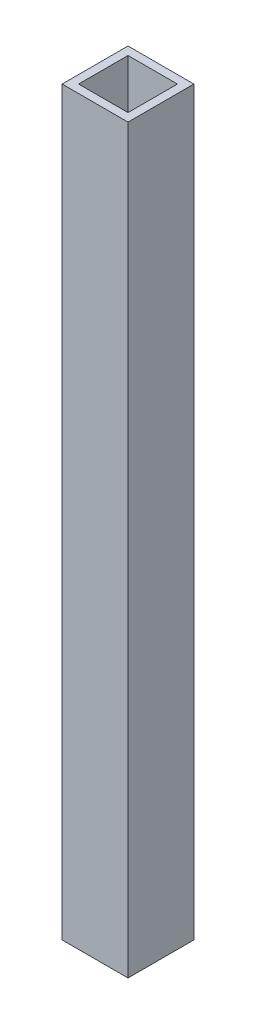
ISO-10303-21;
HEADER;
FILE_DESCRIPTION(('STEP AP214'),'2;1');
FILE_NAME('part.step','',(''),(''),'','','');
FILE_SCHEMA(('AUTOMOTIVE_DESIGN { 1 0 10303 214 1 1 1 1 }'));
ENDSEC;
DATA;
#1=APPLICATION_CONTEXT('core data for automotive mechanical design processes');
#2=APPLICATION_PROTOCOL_DEFINITION('international standard','automotive_design',2000,#1);
#3=PRODUCT_CONTEXT('',#1,'mechanical');
#4=PRODUCT('Part','Part','',(#3));
#5=PRODUCT_RELATED_PRODUCT_CATEGORY('part','',(#4));
#6=PRODUCT_DEFINITION_FORMATION('','',#4);
#7=PRODUCT_DEFINITION_CONTEXT('part definition',#1,'design');
#8=PRODUCT_DEFINITION('design','',#6,#7);
#9=PRODUCT_DEFINITION_SHAPE('','',#8);
#10=(LENGTH_UNIT() NAMED_UNIT(*) SI_UNIT(.MILLI.,.METRE.));
#11=(NAMED_UNIT(*) PLANE_ANGLE_UNIT() SI_UNIT($,.RADIAN.));
#12=(NAMED_UNIT(*) SI_UNIT($,.STERADIAN.) SOLID_ANGLE_UNIT());
#13=UNCERTAINTY_MEASURE_WITH_UNIT(LENGTH_MEASURE(1.E-05),#10,'distance_accuracy_value','');
#14=(GEOMETRIC_REPRESENTATION_CONTEXT(3) GLOBAL_UNCERTAINTY_ASSIGNED_CONTEXT((#13)) GLOBAL_UNIT_ASSIGNED_CONTEXT((#10,
#11,#12)) REPRESENTATION_CONTEXT('',''));
#15=CARTESIAN_POINT('',(0.,0.,0.));
#16=DIRECTION('',(0.,0.,1.));
#17=DIRECTION('',(1.,0.,0.));
#18=AXIS2_PLACEMENT_3D('',#15,#16,#17);
#19=CARTESIAN_POINT('',(0.,225.,0.));
#20=DIRECTION('',(0.,1.,0.));
#21=DIRECTION('',(0.,0.,1.));
#22=AXIS2_PLACEMENT_3D('',#19,#20,#21);
#23=PLANE('',#22);
#24=DIRECTION('',(0.,0.,1.));
#25=VECTOR('',#24,1.);
#26=CARTESIAN_POINT('',(-20.,225.,20.));
#27=LINE('',#26,#25);
#28=CARTESIAN_POINT('',(-20.,225.,-20.));
#29=VERTEX_POINT('',#28);
#30=CARTESIAN_POINT('',(-20.,225.,20.));
#31=VERTEX_POINT('',#30);
#32=EDGE_CURVE('E135',#29,#31,#27,.T.);
#33=ORIENTED_EDGE('',*,*,#32,.T.);
#34=DIRECTION('',(1.,0.,0.));
#35=VECTOR('',#34,1.);
#36=CARTESIAN_POINT('',(20.,225.,20.));
#37=LINE('',#36,#35);
#38=CARTESIAN_POINT('',(20.,225.,20.));
#39=VERTEX_POINT('',#38);
#40=EDGE_CURVE('E138',#31,#39,#37,.T.);
#41=ORIENTED_EDGE('',*,*,#40,.T.);
#42=DIRECTION('',(0.,0.,-1.));
#43=VECTOR('',#42,1.);
#44=CARTESIAN_POINT('',(20.,225.,20.));
#45=LINE('',#44,#43);
#46=CARTESIAN_POINT('',(20.,225.,-20.));
#47=VERTEX_POINT('',#46);
#48=EDGE_CURVE('E141',#39,#47,#45,.T.);
#49=ORIENTED_EDGE('',*,*,#48,.T.);
#50=DIRECTION('',(-1.,0.,0.));
#51=VECTOR('',#50,1.);
#52=CARTESIAN_POINT('',(20.,225.,-20.));
#53=LINE('',#52,#51);
#54=EDGE_CURVE('E143',#47,#29,#53,.T.);
#55=ORIENTED_EDGE('',*,*,#54,.T.);
#56=EDGE_LOOP('',(#33,#41,#49,#55));
#57=FACE_BOUND('',#56,.T.);
#58=DIRECTION('',(-1.,0.,0.));
#59=VECTOR('',#58,1.);
#60=CARTESIAN_POINT('',(15.,225.,-15.));
#61=LINE('',#60,#59);
#62=CARTESIAN_POINT('',(15.,225.,-15.));
#63=VERTEX_POINT('',#62);
#64=CARTESIAN_POINT('',(-15.,225.,-15.));
#65=VERTEX_POINT('',#64);
#66=EDGE_CURVE('E107',#63,#65,#61,.T.);
#67=ORIENTED_EDGE('',*,*,#66,.F.);
#68=DIRECTION('',(0.,0.,-1.));
#69=VECTOR('',#68,1.);
#70=CARTESIAN_POINT('',(15.,225.,15.));
#71=LINE('',#70,#69);
#72=CARTESIAN_POINT('',(15.,225.,15.));
#73=VERTEX_POINT('',#72);
#74=EDGE_CURVE('E99',#73,#63,#71,.T.);
#75=ORIENTED_EDGE('',*,*,#74,.F.);
#76=DIRECTION('',(1.,0.,0.));
#77=VECTOR('',#76,1.);
#78=CARTESIAN_POINT('',(15.,225.,15.));
#79=LINE('',#78,#77);
#80=CARTESIAN_POINT('',(-15.,225.,15.));
#81=VERTEX_POINT('',#80);
#82=EDGE_CURVE('E121',#81,#73,#79,.T.);
#83=ORIENTED_EDGE('',*,*,#82,.F.);
#84=DIRECTION('',(0.,0.,1.));
#85=VECTOR('',#84,1.);
#86=CARTESIAN_POINT('',(-15.,225.,15.));
#87=LINE('',#86,#85);
#88=EDGE_CURVE('E119',#65,#81,#87,.T.);
#89=ORIENTED_EDGE('',*,*,#88,.F.);
#90=EDGE_LOOP('',(#67,#75,#83,#89));
#91=FACE_BOUND('',#90,.T.);
#92=ADVANCED_FACE('F34',(#57,#91),#23,.T.);
#93=CARTESIAN_POINT('',(0.,-225.,0.));
#94=DIRECTION('',(0.,1.,0.));
#95=DIRECTION('',(0.,0.,1.));
#96=AXIS2_PLACEMENT_3D('',#93,#94,#95);
#97=PLANE('',#96);
#98=DIRECTION('',(0.,0.,1.));
#99=VECTOR('',#98,1.);
#100=CARTESIAN_POINT('',(-20.,-225.,20.));
#101=LINE('',#100,#99);
#102=CARTESIAN_POINT('',(-20.,-225.,-20.));
#103=VERTEX_POINT('',#102);
#104=CARTESIAN_POINT('',(-20.,-225.,20.));
#105=VERTEX_POINT('',#104);
#106=EDGE_CURVE('E115',#103,#105,#101,.T.);
#107=ORIENTED_EDGE('',*,*,#106,.F.);
#108=DIRECTION('',(-1.,0.,0.));
#109=VECTOR('',#108,1.);
#110=CARTESIAN_POINT('',(20.,-225.,-20.));
#111=LINE('',#110,#109);
#112=CARTESIAN_POINT('',(20.,-225.,-20.));
#113=VERTEX_POINT('',#112);
#114=EDGE_CURVE('E139',#113,#103,#111,.T.);
#115=ORIENTED_EDGE('',*,*,#114,.F.);
#116=DIRECTION('',(0.,0.,-1.));
#117=VECTOR('',#116,1.);
#118=CARTESIAN_POINT('',(20.,-225.,20.));
#119=LINE('',#118,#117);
#120=CARTESIAN_POINT('',(20.,-225.,20.));
#121=VERTEX_POINT('',#120);
#122=EDGE_CURVE('E150',#121,#113,#119,.T.);
#123=ORIENTED_EDGE('',*,*,#122,.F.);
#124=DIRECTION('',(1.,0.,0.));
#125=VECTOR('',#124,1.);
#126=CARTESIAN_POINT('',(20.,-225.,20.));
#127=LINE('',#126,#125);
#128=EDGE_CURVE('E148',#105,#121,#127,.T.);
#129=ORIENTED_EDGE('',*,*,#128,.F.);
#130=EDGE_LOOP('',(#107,#115,#123,#129));
#131=FACE_BOUND('',#130,.T.);
#132=DIRECTION('',(0.,0.,-1.));
#133=VECTOR('',#132,1.);
#134=CARTESIAN_POINT('',(15.,-225.,15.));
#135=LINE('',#134,#133);
#136=CARTESIAN_POINT('',(15.,-225.,15.));
#137=VERTEX_POINT('',#136);
#138=CARTESIAN_POINT('',(15.,-225.,-15.));
#139=VERTEX_POINT('',#138);
#140=EDGE_CURVE('E57',#137,#139,#135,.T.);
#141=ORIENTED_EDGE('',*,*,#140,.T.);
#142=DIRECTION('',(-1.,0.,0.));
#143=VECTOR('',#142,1.);
#144=CARTESIAN_POINT('',(15.,-225.,-15.));
#145=LINE('',#144,#143);
#146=CARTESIAN_POINT('',(-15.,-225.,-15.));
#147=VERTEX_POINT('',#146);
#148=EDGE_CURVE('E114',#139,#147,#145,.T.);
#149=ORIENTED_EDGE('',*,*,#148,.T.);
#150=DIRECTION('',(0.,0.,1.));
#151=VECTOR('',#150,1.);
#152=CARTESIAN_POINT('',(-15.,-225.,15.));
#153=LINE('',#152,#151);
#154=CARTESIAN_POINT('',(-15.,-225.,15.));
#155=VERTEX_POINT('',#154);
#156=EDGE_CURVE('E127',#147,#155,#153,.T.);
#157=ORIENTED_EDGE('',*,*,#156,.T.);
#158=DIRECTION('',(1.,0.,0.));
#159=VECTOR('',#158,1.);
#160=CARTESIAN_POINT('',(15.,-225.,15.));
#161=LINE('',#160,#159);
#162=EDGE_CURVE('E108',#155,#137,#161,.T.);
#163=ORIENTED_EDGE('',*,*,#162,.T.);
#164=EDGE_LOOP('',(#141,#149,#157,#163));
#165=FACE_BOUND('',#164,.T.);
#166=ADVANCED_FACE('F168',(#131,#165),#97,.F.);
#167=CARTESIAN_POINT('',(-20.,225.,20.));
#168=DIRECTION('',(1.,0.,0.));
#169=DIRECTION('',(0.,0.,-1.));
#170=AXIS2_PLACEMENT_3D('',#167,#168,#169);
#171=PLANE('',#170);
#172=ORIENTED_EDGE('',*,*,#106,.T.);
#173=DIRECTION('',(0.,-1.,0.));
#174=VECTOR('',#173,1.);
#175=CARTESIAN_POINT('',(-20.,225.,20.));
#176=LINE('',#175,#174);
#177=EDGE_CURVE('E11',#31,#105,#176,.T.);
#178=ORIENTED_EDGE('',*,*,#177,.F.);
#179=ORIENTED_EDGE('',*,*,#32,.F.);
#180=DIRECTION('',(0.,-1.,0.));
#181=VECTOR('',#180,1.);
#182=CARTESIAN_POINT('',(-20.,225.,-20.));
#183=LINE('',#182,#181);
#184=EDGE_CURVE('E145',#29,#103,#183,.T.);
#185=ORIENTED_EDGE('',*,*,#184,.T.);
#186=EDGE_LOOP('',(#172,#178,#179,#185));
#187=FACE_BOUND('',#186,.T.);
#188=ADVANCED_FACE('F36',(#187),#171,.F.);
#189=CARTESIAN_POINT('',(20.,225.,20.));
#190=DIRECTION('',(0.,0.,-1.));
#191=DIRECTION('',(-1.,0.,0.));
#192=AXIS2_PLACEMENT_3D('',#189,#190,#191);
#193=PLANE('',#192);
#194=ORIENTED_EDGE('',*,*,#128,.T.);
#195=DIRECTION('',(0.,-1.,0.));
#196=VECTOR('',#195,1.);
#197=CARTESIAN_POINT('',(20.,225.,20.));
#198=LINE('',#197,#196);
#199=EDGE_CURVE('E42',#39,#121,#198,.T.);
#200=ORIENTED_EDGE('',*,*,#199,.F.);
#201=ORIENTED_EDGE('',*,*,#40,.F.);
#202=ORIENTED_EDGE('',*,*,#177,.T.);
#203=EDGE_LOOP('',(#194,#200,#201,#202));
#204=FACE_BOUND('',#203,.T.);
#205=ADVANCED_FACE('F178',(#204),#193,.F.);
#206=CARTESIAN_POINT('',(20.,225.,20.));
#207=DIRECTION('',(-1.,0.,0.));
#208=DIRECTION('',(0.,0.,1.));
#209=AXIS2_PLACEMENT_3D('',#206,#207,#208);
#210=PLANE('',#209);
#211=ORIENTED_EDGE('',*,*,#122,.T.);
#212=DIRECTION('',(0.,-1.,0.));
#213=VECTOR('',#212,1.);
#214=CARTESIAN_POINT('',(20.,225.,-20.));
#215=LINE('',#214,#213);
#216=EDGE_CURVE('E155',#47,#113,#215,.T.);
#217=ORIENTED_EDGE('',*,*,#216,.F.);
#218=ORIENTED_EDGE('',*,*,#48,.F.);
#219=ORIENTED_EDGE('',*,*,#199,.T.);
#220=EDGE_LOOP('',(#211,#217,#218,#219));
#221=FACE_BOUND('',#220,.T.);
#222=ADVANCED_FACE('F162',(#221),#210,.F.);
#223=CARTESIAN_POINT('',(20.,225.,-20.));
#224=DIRECTION('',(0.,0.,1.));
#225=DIRECTION('',(1.,0.,0.));
#226=AXIS2_PLACEMENT_3D('',#223,#224,#225);
#227=PLANE('',#226);
#228=ORIENTED_EDGE('',*,*,#114,.T.);
#229=ORIENTED_EDGE('',*,*,#184,.F.);
#230=ORIENTED_EDGE('',*,*,#54,.F.);
#231=ORIENTED_EDGE('',*,*,#216,.T.);
#232=EDGE_LOOP('',(#228,#229,#230,#231));
#233=FACE_BOUND('',#232,.T.);
#234=ADVANCED_FACE('F172',(#233),#227,.F.);
#235=CARTESIAN_POINT('',(15.,225.,15.));
#236=DIRECTION('',(-1.,0.,0.));
#237=DIRECTION('',(0.,0.,1.));
#238=AXIS2_PLACEMENT_3D('',#235,#236,#237);
#239=PLANE('',#238);
#240=ORIENTED_EDGE('',*,*,#140,.F.);
#241=DIRECTION('',(0.,-1.,0.));
#242=VECTOR('',#241,1.);
#243=CARTESIAN_POINT('',(15.,225.,15.));
#244=LINE('',#243,#242);
#245=EDGE_CURVE('E103',#73,#137,#244,.T.);
#246=ORIENTED_EDGE('',*,*,#245,.F.);
#247=ORIENTED_EDGE('',*,*,#74,.T.);
#248=DIRECTION('',(0.,-1.,0.));
#249=VECTOR('',#248,1.);
#250=CARTESIAN_POINT('',(15.,225.,-15.));
#251=LINE('',#250,#249);
#252=EDGE_CURVE('E102',#63,#139,#251,.T.);
#253=ORIENTED_EDGE('',*,*,#252,.T.);
#254=EDGE_LOOP('',(#240,#246,#247,#253));
#255=FACE_BOUND('',#254,.T.);
#256=ADVANCED_FACE('F101',(#255),#239,.T.);
#257=CARTESIAN_POINT('',(15.,225.,-15.));
#258=DIRECTION('',(0.,0.,1.));
#259=DIRECTION('',(1.,0.,0.));
#260=AXIS2_PLACEMENT_3D('',#257,#258,#259);
#261=PLANE('',#260);
#262=ORIENTED_EDGE('',*,*,#148,.F.);
#263=ORIENTED_EDGE('',*,*,#252,.F.);
#264=ORIENTED_EDGE('',*,*,#66,.T.);
#265=DIRECTION('',(0.,-1.,0.));
#266=VECTOR('',#265,1.);
#267=CARTESIAN_POINT('',(-15.,225.,-15.));
#268=LINE('',#267,#266);
#269=EDGE_CURVE('E116',#65,#147,#268,.T.);
#270=ORIENTED_EDGE('',*,*,#269,.T.);
#271=EDGE_LOOP('',(#262,#263,#264,#270));
#272=FACE_BOUND('',#271,.T.);
#273=ADVANCED_FACE('F111',(#272),#261,.T.);
#274=CARTESIAN_POINT('',(-15.,225.,15.));
#275=DIRECTION('',(1.,0.,0.));
#276=DIRECTION('',(0.,0.,-1.));
#277=AXIS2_PLACEMENT_3D('',#274,#275,#276);
#278=PLANE('',#277);
#279=ORIENTED_EDGE('',*,*,#156,.F.);
#280=ORIENTED_EDGE('',*,*,#269,.F.);
#281=ORIENTED_EDGE('',*,*,#88,.T.);
#282=DIRECTION('',(0.,-1.,0.));
#283=VECTOR('',#282,1.);
#284=CARTESIAN_POINT('',(-15.,225.,15.));
#285=LINE('',#284,#283);
#286=EDGE_CURVE('E49',#81,#155,#285,.T.);
#287=ORIENTED_EDGE('',*,*,#286,.T.);
#288=EDGE_LOOP('',(#279,#280,#281,#287));
#289=FACE_BOUND('',#288,.T.);
#290=ADVANCED_FACE('F201',(#289),#278,.T.);
#291=CARTESIAN_POINT('',(15.,225.,15.));
#292=DIRECTION('',(0.,0.,-1.));
#293=DIRECTION('',(-1.,0.,0.));
#294=AXIS2_PLACEMENT_3D('',#291,#292,#293);
#295=PLANE('',#294);
#296=ORIENTED_EDGE('',*,*,#162,.F.);
#297=ORIENTED_EDGE('',*,*,#286,.F.);
#298=ORIENTED_EDGE('',*,*,#82,.T.);
#299=ORIENTED_EDGE('',*,*,#245,.T.);
#300=EDGE_LOOP('',(#296,#297,#298,#299));
#301=FACE_BOUND('',#300,.T.);
#302=ADVANCED_FACE('F205',(#301),#295,.T.);
#303=CLOSED_SHELL('',(#92,#166,#188,#205,#222,#234,#256,#273,#290,#302));
#304=MANIFOLD_SOLID_BREP('B2',#303);
#305=ADVANCED_BREP_SHAPE_REPRESENTATION('',(#18,#304),#14);
#306=SHAPE_DEFINITION_REPRESENTATION(#9,#305);
ENDSEC;
END-ISO-10303-21;
